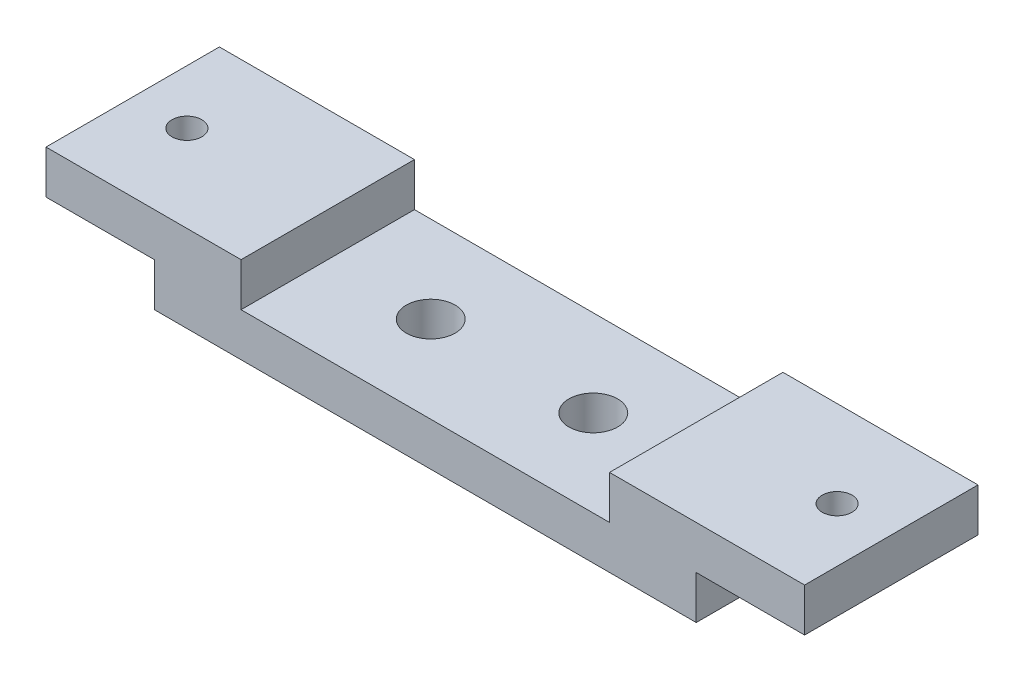
ISO-10303-21;
HEADER;
FILE_DESCRIPTION(('STEP AP214'),'2;1');
FILE_NAME('part.step','',(''),(''),'','','');
FILE_SCHEMA(('AUTOMOTIVE_DESIGN { 1 0 10303 214 1 1 1 1 }'));
ENDSEC;
DATA;
#1=APPLICATION_CONTEXT('core data for automotive mechanical design processes');
#2=APPLICATION_PROTOCOL_DEFINITION('international standard','automotive_design',2000,#1);
#3=PRODUCT_CONTEXT('',#1,'mechanical');
#4=PRODUCT('Part','Part','',(#3));
#5=PRODUCT_RELATED_PRODUCT_CATEGORY('part','',(#4));
#6=PRODUCT_DEFINITION_FORMATION('','',#4);
#7=PRODUCT_DEFINITION_CONTEXT('part definition',#1,'design');
#8=PRODUCT_DEFINITION('design','',#6,#7);
#9=PRODUCT_DEFINITION_SHAPE('','',#8);
#10=(LENGTH_UNIT() NAMED_UNIT(*) SI_UNIT(.MILLI.,.METRE.));
#11=(NAMED_UNIT(*) PLANE_ANGLE_UNIT() SI_UNIT($,.RADIAN.));
#12=(NAMED_UNIT(*) SI_UNIT($,.STERADIAN.) SOLID_ANGLE_UNIT());
#13=UNCERTAINTY_MEASURE_WITH_UNIT(LENGTH_MEASURE(1.E-05),#10,'distance_accuracy_value','');
#14=(GEOMETRIC_REPRESENTATION_CONTEXT(3) GLOBAL_UNCERTAINTY_ASSIGNED_CONTEXT((#13)) GLOBAL_UNIT_ASSIGNED_CONTEXT((#10,
#11,#12)) REPRESENTATION_CONTEXT('',''));
#15=CARTESIAN_POINT('',(0.,0.,0.));
#16=DIRECTION('',(0.,0.,1.));
#17=DIRECTION('',(1.,0.,0.));
#18=AXIS2_PLACEMENT_3D('',#15,#16,#17);
#19=CARTESIAN_POINT('',(-50.,8.,32.));
#20=DIRECTION('',(0.,1.,0.));
#21=DIRECTION('',(0.,0.,1.));
#22=AXIS2_PLACEMENT_3D('',#19,#20,#21);
#23=PLANE('',#22);
#24=DIRECTION('',(1.,0.,0.));
#25=VECTOR('',#24,1.);
#26=CARTESIAN_POINT('',(-50.,8.,0.));
#27=LINE('',#26,#25);
#28=CARTESIAN_POINT('',(-70.,8.,0.));
#29=VERTEX_POINT('',#28);
#30=CARTESIAN_POINT('',(-50.,8.,0.));
#31=VERTEX_POINT('',#30);
#32=EDGE_CURVE('E170',#29,#31,#27,.T.);
#33=ORIENTED_EDGE('',*,*,#32,.T.);
#34=DIRECTION('',(0.,0.,-1.));
#35=VECTOR('',#34,1.);
#36=CARTESIAN_POINT('',(-50.,8.,32.));
#37=LINE('',#36,#35);
#38=CARTESIAN_POINT('',(-50.,8.,32.));
#39=VERTEX_POINT('',#38);
#40=EDGE_CURVE('E49',#39,#31,#37,.T.);
#41=ORIENTED_EDGE('',*,*,#40,.F.);
#42=DIRECTION('',(1.,0.,0.));
#43=VECTOR('',#42,1.);
#44=CARTESIAN_POINT('',(-50.,8.,32.));
#45=LINE('',#44,#43);
#46=CARTESIAN_POINT('',(-70.,8.,32.));
#47=VERTEX_POINT('',#46);
#48=EDGE_CURVE('E112',#47,#39,#45,.T.);
#49=ORIENTED_EDGE('',*,*,#48,.F.);
#50=DIRECTION('',(0.,0.,-1.));
#51=VECTOR('',#50,1.);
#52=CARTESIAN_POINT('',(-70.,8.,32.));
#53=LINE('',#52,#51);
#54=EDGE_CURVE('E11',#47,#29,#53,.T.);
#55=ORIENTED_EDGE('',*,*,#54,.T.);
#56=EDGE_LOOP('',(#33,#41,#49,#55));
#57=FACE_BOUND('',#56,.T.);
#58=CARTESIAN_POINT('',(-60.,8.,16.));
#59=DIRECTION('',(0.,-1.,0.));
#60=DIRECTION('',(0.,0.,-1.));
#61=AXIS2_PLACEMENT_3D('',#58,#59,#60);
#62=CIRCLE('',#61,2.75);
#63=CARTESIAN_POINT('',(-60.,8.,13.25));
#64=VERTEX_POINT('',#63);
#65=EDGE_CURVE('E428',#64,#64,#62,.T.);
#66=ORIENTED_EDGE('',*,*,#65,.F.);
#67=EDGE_LOOP('',(#66));
#68=FACE_BOUND('',#67,.T.);
#69=ADVANCED_FACE('F39',(#57,#68),#23,.F.);
#70=CARTESIAN_POINT('',(-34.,8.,32.));
#71=DIRECTION('',(0.,-1.,0.));
#72=DIRECTION('',(0.,0.,-1.));
#73=AXIS2_PLACEMENT_3D('',#70,#71,#72);
#74=PLANE('',#73);
#75=CARTESIAN_POINT('',(-15.,8.,16.));
#76=DIRECTION('',(0.,1.,0.));
#77=DIRECTION('',(0.,0.,1.));
#78=AXIS2_PLACEMENT_3D('',#75,#76,#77);
#79=CIRCLE('',#78,4.5);
#80=CARTESIAN_POINT('',(-15.,8.,20.5));
#81=VERTEX_POINT('',#80);
#82=EDGE_CURVE('E450',#81,#81,#79,.T.);
#83=ORIENTED_EDGE('',*,*,#82,.F.);
#84=EDGE_LOOP('',(#83));
#85=FACE_BOUND('',#84,.T.);
#86=DIRECTION('',(-1.,0.,0.));
#87=VECTOR('',#86,1.);
#88=CARTESIAN_POINT('',(-34.,8.,0.));
#89=LINE('',#88,#87);
#90=CARTESIAN_POINT('',(34.,8.,0.));
#91=VERTEX_POINT('',#90);
#92=CARTESIAN_POINT('',(-34.,8.,0.));
#93=VERTEX_POINT('',#92);
#94=EDGE_CURVE('E153',#91,#93,#89,.T.);
#95=ORIENTED_EDGE('',*,*,#94,.T.);
#96=DIRECTION('',(0.,0.,-1.));
#97=VECTOR('',#96,1.);
#98=CARTESIAN_POINT('',(-34.,8.,32.));
#99=LINE('',#98,#97);
#100=CARTESIAN_POINT('',(-34.,8.,32.));
#101=VERTEX_POINT('',#100);
#102=EDGE_CURVE('E149',#101,#93,#99,.T.);
#103=ORIENTED_EDGE('',*,*,#102,.F.);
#104=DIRECTION('',(-1.,0.,0.));
#105=VECTOR('',#104,1.);
#106=CARTESIAN_POINT('',(-34.,8.,32.));
#107=LINE('',#106,#105);
#108=CARTESIAN_POINT('',(34.,8.,32.));
#109=VERTEX_POINT('',#108);
#110=EDGE_CURVE('E137',#109,#101,#107,.T.);
#111=ORIENTED_EDGE('',*,*,#110,.F.);
#112=DIRECTION('',(0.,0.,-1.));
#113=VECTOR('',#112,1.);
#114=CARTESIAN_POINT('',(34.,8.,32.));
#115=LINE('',#114,#113);
#116=EDGE_CURVE('E155',#109,#91,#115,.T.);
#117=ORIENTED_EDGE('',*,*,#116,.T.);
#118=EDGE_LOOP('',(#95,#103,#111,#117));
#119=FACE_BOUND('',#118,.T.);
#120=CARTESIAN_POINT('',(15.,8.,16.));
#121=DIRECTION('',(0.,1.,0.));
#122=DIRECTION('',(0.,0.,1.));
#123=AXIS2_PLACEMENT_3D('',#120,#121,#122);
#124=CIRCLE('',#123,4.5);
#125=CARTESIAN_POINT('',(15.,8.,20.5));
#126=VERTEX_POINT('',#125);
#127=EDGE_CURVE('E442',#126,#126,#124,.T.);
#128=ORIENTED_EDGE('',*,*,#127,.F.);
#129=EDGE_LOOP('',(#128));
#130=FACE_BOUND('',#129,.T.);
#131=ADVANCED_FACE('F150',(#85,#119,#130),#74,.F.);
#132=CARTESIAN_POINT('',(-70.,8.,32.));
#133=DIRECTION('',(1.,0.,0.));
#134=DIRECTION('',(0.,0.,-1.));
#135=AXIS2_PLACEMENT_3D('',#132,#133,#134);
#136=PLANE('',#135);
#137=DIRECTION('',(0.,-1.,0.));
#138=VECTOR('',#137,1.);
#139=CARTESIAN_POINT('',(-70.,8.,0.));
#140=LINE('',#139,#138);
#141=CARTESIAN_POINT('',(-70.,16.,0.));
#142=VERTEX_POINT('',#141);
#143=EDGE_CURVE('E166',#142,#29,#140,.T.);
#144=ORIENTED_EDGE('',*,*,#143,.T.);
#145=ORIENTED_EDGE('',*,*,#54,.F.);
#146=DIRECTION('',(0.,-1.,0.));
#147=VECTOR('',#146,1.);
#148=CARTESIAN_POINT('',(-70.,8.,32.));
#149=LINE('',#148,#147);
#150=CARTESIAN_POINT('',(-70.,16.,32.));
#151=VERTEX_POINT('',#150);
#152=EDGE_CURVE('E201',#151,#47,#149,.T.);
#153=ORIENTED_EDGE('',*,*,#152,.F.);
#154=DIRECTION('',(0.,0.,-1.));
#155=VECTOR('',#154,1.);
#156=CARTESIAN_POINT('',(-70.,16.,32.));
#157=LINE('',#156,#155);
#158=EDGE_CURVE('E162',#151,#142,#157,.T.);
#159=ORIENTED_EDGE('',*,*,#158,.T.);
#160=EDGE_LOOP('',(#144,#145,#153,#159));
#161=FACE_BOUND('',#160,.T.);
#162=ADVANCED_FACE('F41',(#161),#136,.F.);
#163=CARTESIAN_POINT('',(-50.,8.,32.));
#164=DIRECTION('',(1.,0.,0.));
#165=DIRECTION('',(0.,0.,-1.));
#166=AXIS2_PLACEMENT_3D('',#163,#164,#165);
#167=PLANE('',#166);
#168=DIRECTION('',(0.,-1.,0.));
#169=VECTOR('',#168,1.);
#170=CARTESIAN_POINT('',(-50.,8.,0.));
#171=LINE('',#170,#169);
#172=CARTESIAN_POINT('',(-50.,0.,0.));
#173=VERTEX_POINT('',#172);
#174=EDGE_CURVE('E174',#31,#173,#171,.T.);
#175=ORIENTED_EDGE('',*,*,#174,.T.);
#176=DIRECTION('',(0.,0.,-1.));
#177=VECTOR('',#176,1.);
#178=CARTESIAN_POINT('',(-50.,0.,32.));
#179=LINE('',#178,#177);
#180=CARTESIAN_POINT('',(-50.,0.,32.));
#181=VERTEX_POINT('',#180);
#182=EDGE_CURVE('E228',#181,#173,#179,.T.);
#183=ORIENTED_EDGE('',*,*,#182,.F.);
#184=DIRECTION('',(0.,-1.,0.));
#185=VECTOR('',#184,1.);
#186=CARTESIAN_POINT('',(-50.,8.,32.));
#187=LINE('',#186,#185);
#188=EDGE_CURVE('E238',#39,#181,#187,.T.);
#189=ORIENTED_EDGE('',*,*,#188,.F.);
#190=ORIENTED_EDGE('',*,*,#40,.T.);
#191=EDGE_LOOP('',(#175,#183,#189,#190));
#192=FACE_BOUND('',#191,.T.);
#193=ADVANCED_FACE('F236',(#192),#167,.F.);
#194=CARTESIAN_POINT('',(-50.,0.,32.));
#195=DIRECTION('',(0.,1.,0.));
#196=DIRECTION('',(-1.,0.,0.));
#197=AXIS2_PLACEMENT_3D('',#194,#195,#196);
#198=PLANE('',#197);
#199=CARTESIAN_POINT('',(15.,0.,16.));
#200=DIRECTION('',(0.,1.,0.));
#201=DIRECTION('',(0.,0.,1.));
#202=AXIS2_PLACEMENT_3D('',#199,#200,#201);
#203=CIRCLE('',#202,4.5);
#204=CARTESIAN_POINT('',(15.,0.,20.5));
#205=VERTEX_POINT('',#204);
#206=EDGE_CURVE('E446',#205,#205,#203,.T.);
#207=ORIENTED_EDGE('',*,*,#206,.T.);
#208=EDGE_LOOP('',(#207));
#209=FACE_BOUND('',#208,.T.);
#210=CARTESIAN_POINT('',(-15.,0.,16.));
#211=DIRECTION('',(0.,1.,0.));
#212=DIRECTION('',(0.,0.,1.));
#213=AXIS2_PLACEMENT_3D('',#210,#211,#212);
#214=CIRCLE('',#213,4.5);
#215=CARTESIAN_POINT('',(-15.,0.,20.5));
#216=VERTEX_POINT('',#215);
#217=EDGE_CURVE('E171',#216,#216,#214,.T.);
#218=ORIENTED_EDGE('',*,*,#217,.T.);
#219=EDGE_LOOP('',(#218));
#220=FACE_BOUND('',#219,.T.);
#221=DIRECTION('',(1.,0.,0.));
#222=VECTOR('',#221,1.);
#223=CARTESIAN_POINT('',(-50.,0.,0.));
#224=LINE('',#223,#222);
#225=CARTESIAN_POINT('',(50.,0.,0.));
#226=VERTEX_POINT('',#225);
#227=EDGE_CURVE('E177',#173,#226,#224,.T.);
#228=ORIENTED_EDGE('',*,*,#227,.T.);
#229=DIRECTION('',(0.,0.,-1.));
#230=VECTOR('',#229,1.);
#231=CARTESIAN_POINT('',(50.,0.,32.));
#232=LINE('',#231,#230);
#233=CARTESIAN_POINT('',(50.,0.,32.));
#234=VERTEX_POINT('',#233);
#235=EDGE_CURVE('E224',#234,#226,#232,.T.);
#236=ORIENTED_EDGE('',*,*,#235,.F.);
#237=DIRECTION('',(1.,0.,0.));
#238=VECTOR('',#237,1.);
#239=CARTESIAN_POINT('',(-50.,0.,32.));
#240=LINE('',#239,#238);
#241=EDGE_CURVE('E257',#181,#234,#240,.T.);
#242=ORIENTED_EDGE('',*,*,#241,.F.);
#243=ORIENTED_EDGE('',*,*,#182,.T.);
#244=EDGE_LOOP('',(#228,#236,#242,#243));
#245=FACE_BOUND('',#244,.T.);
#246=ADVANCED_FACE('F247',(#209,#220,#245),#198,.F.);
#247=CARTESIAN_POINT('',(50.,0.,32.));
#248=DIRECTION('',(-1.,0.,0.));
#249=DIRECTION('',(0.,0.,1.));
#250=AXIS2_PLACEMENT_3D('',#247,#248,#249);
#251=PLANE('',#250);
#252=DIRECTION('',(0.,1.,0.));
#253=VECTOR('',#252,1.);
#254=CARTESIAN_POINT('',(50.,0.,0.));
#255=LINE('',#254,#253);
#256=CARTESIAN_POINT('',(50.,8.00000000000002,0.));
#257=VERTEX_POINT('',#256);
#258=EDGE_CURVE('E180',#226,#257,#255,.T.);
#259=ORIENTED_EDGE('',*,*,#258,.T.);
#260=DIRECTION('',(0.,0.,-1.));
#261=VECTOR('',#260,1.);
#262=CARTESIAN_POINT('',(50.,8.00000000000002,32.));
#263=LINE('',#262,#261);
#264=CARTESIAN_POINT('',(50.,8.00000000000002,32.));
#265=VERTEX_POINT('',#264);
#266=EDGE_CURVE('E220',#265,#257,#263,.T.);
#267=ORIENTED_EDGE('',*,*,#266,.F.);
#268=DIRECTION('',(0.,1.,0.));
#269=VECTOR('',#268,1.);
#270=CARTESIAN_POINT('',(50.,0.,32.));
#271=LINE('',#270,#269);
#272=EDGE_CURVE('E253',#234,#265,#271,.T.);
#273=ORIENTED_EDGE('',*,*,#272,.F.);
#274=ORIENTED_EDGE('',*,*,#235,.T.);
#275=EDGE_LOOP('',(#259,#267,#273,#274));
#276=FACE_BOUND('',#275,.T.);
#277=ADVANCED_FACE('F251',(#276),#251,.F.);
#278=CARTESIAN_POINT('',(70.,8.,32.));
#279=DIRECTION('',(0.,1.,0.));
#280=DIRECTION('',(-1.,0.,0.));
#281=AXIS2_PLACEMENT_3D('',#278,#279,#280);
#282=PLANE('',#281);
#283=CARTESIAN_POINT('',(60.,8.00000000000001,16.));
#284=DIRECTION('',(0.,-1.,0.));
#285=DIRECTION('',(0.,0.,-1.));
#286=AXIS2_PLACEMENT_3D('',#283,#284,#285);
#287=CIRCLE('',#286,2.75);
#288=CARTESIAN_POINT('',(60.,8.00000000000001,13.25));
#289=VERTEX_POINT('',#288);
#290=EDGE_CURVE('E432',#289,#289,#287,.T.);
#291=ORIENTED_EDGE('',*,*,#290,.F.);
#292=EDGE_LOOP('',(#291));
#293=FACE_BOUND('',#292,.T.);
#294=DIRECTION('',(1.,0.,0.));
#295=VECTOR('',#294,1.);
#296=CARTESIAN_POINT('',(70.,8.,0.));
#297=LINE('',#296,#295);
#298=CARTESIAN_POINT('',(70.,8.,0.));
#299=VERTEX_POINT('',#298);
#300=EDGE_CURVE('E183',#257,#299,#297,.T.);
#301=ORIENTED_EDGE('',*,*,#300,.T.);
#302=DIRECTION('',(0.,0.,-1.));
#303=VECTOR('',#302,1.);
#304=CARTESIAN_POINT('',(70.,8.,32.));
#305=LINE('',#304,#303);
#306=CARTESIAN_POINT('',(70.,8.,32.));
#307=VERTEX_POINT('',#306);
#308=EDGE_CURVE('E216',#307,#299,#305,.T.);
#309=ORIENTED_EDGE('',*,*,#308,.F.);
#310=DIRECTION('',(1.,0.,0.));
#311=VECTOR('',#310,1.);
#312=CARTESIAN_POINT('',(70.,8.,32.));
#313=LINE('',#312,#311);
#314=EDGE_CURVE('E256',#265,#307,#313,.T.);
#315=ORIENTED_EDGE('',*,*,#314,.F.);
#316=ORIENTED_EDGE('',*,*,#266,.T.);
#317=EDGE_LOOP('',(#301,#309,#315,#316));
#318=FACE_BOUND('',#317,.T.);
#319=ADVANCED_FACE('F311',(#293,#318),#282,.F.);
#320=CARTESIAN_POINT('',(70.,16.,32.));
#321=DIRECTION('',(-1.,0.,0.));
#322=DIRECTION('',(0.,0.,1.));
#323=AXIS2_PLACEMENT_3D('',#320,#321,#322);
#324=PLANE('',#323);
#325=DIRECTION('',(0.,1.,0.));
#326=VECTOR('',#325,1.);
#327=CARTESIAN_POINT('',(70.,16.,0.));
#328=LINE('',#327,#326);
#329=CARTESIAN_POINT('',(70.,16.,0.));
#330=VERTEX_POINT('',#329);
#331=EDGE_CURVE('E186',#299,#330,#328,.T.);
#332=ORIENTED_EDGE('',*,*,#331,.T.);
#333=DIRECTION('',(0.,0.,-1.));
#334=VECTOR('',#333,1.);
#335=CARTESIAN_POINT('',(70.,16.,32.));
#336=LINE('',#335,#334);
#337=CARTESIAN_POINT('',(70.,16.,32.));
#338=VERTEX_POINT('',#337);
#339=EDGE_CURVE('E212',#338,#330,#336,.T.);
#340=ORIENTED_EDGE('',*,*,#339,.F.);
#341=DIRECTION('',(0.,1.,0.));
#342=VECTOR('',#341,1.);
#343=CARTESIAN_POINT('',(70.,16.,32.));
#344=LINE('',#343,#342);
#345=EDGE_CURVE('E261',#307,#338,#344,.T.);
#346=ORIENTED_EDGE('',*,*,#345,.F.);
#347=ORIENTED_EDGE('',*,*,#308,.T.);
#348=EDGE_LOOP('',(#332,#340,#346,#347));
#349=FACE_BOUND('',#348,.T.);
#350=ADVANCED_FACE('F314',(#349),#324,.F.);
#351=CARTESIAN_POINT('',(34.,16.,32.));
#352=DIRECTION('',(0.,-1.,0.));
#353=DIRECTION('',(0.,0.,-1.));
#354=AXIS2_PLACEMENT_3D('',#351,#352,#353);
#355=PLANE('',#354);
#356=CARTESIAN_POINT('',(60.,16.,16.));
#357=DIRECTION('',(0.,-1.,0.));
#358=DIRECTION('',(0.,0.,-1.));
#359=AXIS2_PLACEMENT_3D('',#356,#357,#358);
#360=CIRCLE('',#359,2.75);
#361=CARTESIAN_POINT('',(60.,16.,13.25));
#362=VERTEX_POINT('',#361);
#363=EDGE_CURVE('E438',#362,#362,#360,.T.);
#364=ORIENTED_EDGE('',*,*,#363,.T.);
#365=EDGE_LOOP('',(#364));
#366=FACE_BOUND('',#365,.T.);
#367=DIRECTION('',(-1.,0.,0.));
#368=VECTOR('',#367,1.);
#369=CARTESIAN_POINT('',(34.,16.,0.));
#370=LINE('',#369,#368);
#371=CARTESIAN_POINT('',(34.,16.,0.));
#372=VERTEX_POINT('',#371);
#373=EDGE_CURVE('E189',#330,#372,#370,.T.);
#374=ORIENTED_EDGE('',*,*,#373,.T.);
#375=DIRECTION('',(0.,0.,-1.));
#376=VECTOR('',#375,1.);
#377=CARTESIAN_POINT('',(34.,16.,32.));
#378=LINE('',#377,#376);
#379=CARTESIAN_POINT('',(34.,16.,32.));
#380=VERTEX_POINT('',#379);
#381=EDGE_CURVE('E208',#380,#372,#378,.T.);
#382=ORIENTED_EDGE('',*,*,#381,.F.);
#383=DIRECTION('',(-1.,0.,0.));
#384=VECTOR('',#383,1.);
#385=CARTESIAN_POINT('',(34.,16.,32.));
#386=LINE('',#385,#384);
#387=EDGE_CURVE('E268',#338,#380,#386,.T.);
#388=ORIENTED_EDGE('',*,*,#387,.F.);
#389=ORIENTED_EDGE('',*,*,#339,.T.);
#390=EDGE_LOOP('',(#374,#382,#388,#389));
#391=FACE_BOUND('',#390,.T.);
#392=ADVANCED_FACE('F276',(#366,#391),#355,.F.);
#393=CARTESIAN_POINT('',(34.,8.,32.));
#394=DIRECTION('',(1.,0.,0.));
#395=DIRECTION('',(0.,0.,-1.));
#396=AXIS2_PLACEMENT_3D('',#393,#394,#395);
#397=PLANE('',#396);
#398=DIRECTION('',(0.,-1.,0.));
#399=VECTOR('',#398,1.);
#400=CARTESIAN_POINT('',(34.,8.,0.));
#401=LINE('',#400,#399);
#402=EDGE_CURVE('E192',#372,#91,#401,.T.);
#403=ORIENTED_EDGE('',*,*,#402,.T.);
#404=ORIENTED_EDGE('',*,*,#116,.F.);
#405=DIRECTION('',(0.,-1.,0.));
#406=VECTOR('',#405,1.);
#407=CARTESIAN_POINT('',(34.,8.,32.));
#408=LINE('',#407,#406);
#409=EDGE_CURVE('E143',#380,#109,#408,.T.);
#410=ORIENTED_EDGE('',*,*,#409,.F.);
#411=ORIENTED_EDGE('',*,*,#381,.T.);
#412=EDGE_LOOP('',(#403,#404,#410,#411));
#413=FACE_BOUND('',#412,.T.);
#414=ADVANCED_FACE('F280',(#413),#397,.F.);
#415=CARTESIAN_POINT('',(-34.,16.,32.));
#416=DIRECTION('',(-1.,0.,0.));
#417=DIRECTION('',(0.,0.,1.));
#418=AXIS2_PLACEMENT_3D('',#415,#416,#417);
#419=PLANE('',#418);
#420=DIRECTION('',(0.,1.,0.));
#421=VECTOR('',#420,1.);
#422=CARTESIAN_POINT('',(-34.,16.,0.));
#423=LINE('',#422,#421);
#424=CARTESIAN_POINT('',(-34.,16.,0.));
#425=VERTEX_POINT('',#424);
#426=EDGE_CURVE('E98',#93,#425,#423,.T.);
#427=ORIENTED_EDGE('',*,*,#426,.T.);
#428=DIRECTION('',(0.,0.,-1.));
#429=VECTOR('',#428,1.);
#430=CARTESIAN_POINT('',(-34.,16.,32.));
#431=LINE('',#430,#429);
#432=CARTESIAN_POINT('',(-34.,16.,32.));
#433=VERTEX_POINT('',#432);
#434=EDGE_CURVE('E156',#433,#425,#431,.T.);
#435=ORIENTED_EDGE('',*,*,#434,.F.);
#436=DIRECTION('',(0.,1.,0.));
#437=VECTOR('',#436,1.);
#438=CARTESIAN_POINT('',(-34.,16.,32.));
#439=LINE('',#438,#437);
#440=EDGE_CURVE('E141',#101,#433,#439,.T.);
#441=ORIENTED_EDGE('',*,*,#440,.F.);
#442=ORIENTED_EDGE('',*,*,#102,.T.);
#443=EDGE_LOOP('',(#427,#435,#441,#442));
#444=FACE_BOUND('',#443,.T.);
#445=ADVANCED_FACE('F158',(#444),#419,.F.);
#446=CARTESIAN_POINT('',(-70.,16.,32.));
#447=DIRECTION('',(0.,-1.,0.));
#448=DIRECTION('',(0.,0.,-1.));
#449=AXIS2_PLACEMENT_3D('',#446,#447,#448);
#450=PLANE('',#449);
#451=CARTESIAN_POINT('',(-60.,16.,16.));
#452=DIRECTION('',(0.,-1.,0.));
#453=DIRECTION('',(0.,0.,-1.));
#454=AXIS2_PLACEMENT_3D('',#451,#452,#453);
#455=CIRCLE('',#454,2.75);
#456=CARTESIAN_POINT('',(-60.,16.,13.25));
#457=VERTEX_POINT('',#456);
#458=EDGE_CURVE('E425',#457,#457,#455,.T.);
#459=ORIENTED_EDGE('',*,*,#458,.T.);
#460=EDGE_LOOP('',(#459));
#461=FACE_BOUND('',#460,.T.);
#462=DIRECTION('',(-1.,0.,0.));
#463=VECTOR('',#462,1.);
#464=CARTESIAN_POINT('',(-70.,16.,0.));
#465=LINE('',#464,#463);
#466=EDGE_CURVE('E104',#425,#142,#465,.T.);
#467=ORIENTED_EDGE('',*,*,#466,.T.);
#468=ORIENTED_EDGE('',*,*,#158,.F.);
#469=DIRECTION('',(-1.,0.,0.));
#470=VECTOR('',#469,1.);
#471=CARTESIAN_POINT('',(-70.,16.,32.));
#472=LINE('',#471,#470);
#473=EDGE_CURVE('E57',#433,#151,#472,.T.);
#474=ORIENTED_EDGE('',*,*,#473,.F.);
#475=ORIENTED_EDGE('',*,*,#434,.T.);
#476=EDGE_LOOP('',(#467,#468,#474,#475));
#477=FACE_BOUND('',#476,.T.);
#478=ADVANCED_FACE('F284',(#461,#477),#450,.F.);
#479=CARTESIAN_POINT('',(0.,0.,32.));
#480=DIRECTION('',(0.,0.,-1.));
#481=DIRECTION('',(-1.,0.,0.));
#482=AXIS2_PLACEMENT_3D('',#479,#480,#481);
#483=PLANE('',#482);
#484=ORIENTED_EDGE('',*,*,#152,.T.);
#485=ORIENTED_EDGE('',*,*,#48,.T.);
#486=ORIENTED_EDGE('',*,*,#188,.T.);
#487=ORIENTED_EDGE('',*,*,#241,.T.);
#488=ORIENTED_EDGE('',*,*,#272,.T.);
#489=ORIENTED_EDGE('',*,*,#314,.T.);
#490=ORIENTED_EDGE('',*,*,#345,.T.);
#491=ORIENTED_EDGE('',*,*,#387,.T.);
#492=ORIENTED_EDGE('',*,*,#409,.T.);
#493=ORIENTED_EDGE('',*,*,#110,.T.);
#494=ORIENTED_EDGE('',*,*,#440,.T.);
#495=ORIENTED_EDGE('',*,*,#473,.T.);
#496=EDGE_LOOP('',(#484,#485,#486,#487,#488,#489,#490,#491,#492,#493,#494,#495));
#497=FACE_BOUND('',#496,.T.);
#498=ADVANCED_FACE('F139',(#497),#483,.F.);
#499=CARTESIAN_POINT('',(0.,0.,0.));
#500=DIRECTION('',(0.,0.,-1.));
#501=DIRECTION('',(-1.,0.,0.));
#502=AXIS2_PLACEMENT_3D('',#499,#500,#501);
#503=PLANE('',#502);
#504=ORIENTED_EDGE('',*,*,#143,.F.);
#505=ORIENTED_EDGE('',*,*,#466,.F.);
#506=ORIENTED_EDGE('',*,*,#426,.F.);
#507=ORIENTED_EDGE('',*,*,#94,.F.);
#508=ORIENTED_EDGE('',*,*,#402,.F.);
#509=ORIENTED_EDGE('',*,*,#373,.F.);
#510=ORIENTED_EDGE('',*,*,#331,.F.);
#511=ORIENTED_EDGE('',*,*,#300,.F.);
#512=ORIENTED_EDGE('',*,*,#258,.F.);
#513=ORIENTED_EDGE('',*,*,#227,.F.);
#514=ORIENTED_EDGE('',*,*,#174,.F.);
#515=ORIENTED_EDGE('',*,*,#32,.F.);
#516=EDGE_LOOP('',(#504,#505,#506,#507,#508,#509,#510,#511,#512,#513,#514,#515));
#517=FACE_BOUND('',#516,.T.);
#518=ADVANCED_FACE('F242',(#517),#503,.T.);
#519=CARTESIAN_POINT('',(-15.,8.,16.));
#520=DIRECTION('',(0.,1.,0.));
#521=DIRECTION('',(0.,0.,1.));
#522=AXIS2_PLACEMENT_3D('',#519,#520,#521);
#523=CYLINDRICAL_SURFACE('',#522,4.5);
#524=ORIENTED_EDGE('',*,*,#217,.F.);
#525=EDGE_LOOP('',(#524));
#526=FACE_BOUND('',#525,.T.);
#527=ORIENTED_EDGE('',*,*,#82,.T.);
#528=EDGE_LOOP('',(#527));
#529=FACE_BOUND('',#528,.T.);
#530=ADVANCED_FACE('F348',(#526,#529),#523,.F.);
#531=CARTESIAN_POINT('',(15.,8.,16.));
#532=DIRECTION('',(0.,1.,0.));
#533=DIRECTION('',(0.,0.,1.));
#534=AXIS2_PLACEMENT_3D('',#531,#532,#533);
#535=CYLINDRICAL_SURFACE('',#534,4.5);
#536=ORIENTED_EDGE('',*,*,#206,.F.);
#537=EDGE_LOOP('',(#536));
#538=FACE_BOUND('',#537,.T.);
#539=ORIENTED_EDGE('',*,*,#127,.T.);
#540=EDGE_LOOP('',(#539));
#541=FACE_BOUND('',#540,.T.);
#542=ADVANCED_FACE('F371',(#538,#541),#535,.F.);
#543=CARTESIAN_POINT('',(60.,8.00000000000001,16.));
#544=DIRECTION('',(0.,-1.,0.));
#545=DIRECTION('',(0.,0.,-1.));
#546=AXIS2_PLACEMENT_3D('',#543,#544,#545);
#547=CYLINDRICAL_SURFACE('',#546,2.75);
#548=ORIENTED_EDGE('',*,*,#363,.F.);
#549=EDGE_LOOP('',(#548));
#550=FACE_BOUND('',#549,.T.);
#551=ORIENTED_EDGE('',*,*,#290,.T.);
#552=EDGE_LOOP('',(#551));
#553=FACE_BOUND('',#552,.T.);
#554=ADVANCED_FACE('F380',(#550,#553),#547,.F.);
#555=CARTESIAN_POINT('',(-60.,8.,16.));
#556=DIRECTION('',(0.,-1.,0.));
#557=DIRECTION('',(0.,0.,-1.));
#558=AXIS2_PLACEMENT_3D('',#555,#556,#557);
#559=CYLINDRICAL_SURFACE('',#558,2.75);
#560=ORIENTED_EDGE('',*,*,#458,.F.);
#561=EDGE_LOOP('',(#560));
#562=FACE_BOUND('',#561,.T.);
#563=ORIENTED_EDGE('',*,*,#65,.T.);
#564=EDGE_LOOP('',(#563));
#565=FACE_BOUND('',#564,.T.);
#566=ADVANCED_FACE('F409',(#562,#565),#559,.F.);
#567=CLOSED_SHELL('',(#69,#131,#162,#193,#246,#277,#319,#350,#392,#414,#445,#478,#498,#518,#530,
#542,#554,#566));
#568=MANIFOLD_SOLID_BREP('B2',#567);
#569=ADVANCED_BREP_SHAPE_REPRESENTATION('',(#18,#568),#14);
#570=SHAPE_DEFINITION_REPRESENTATION(#9,#569);
ENDSEC;
END-ISO-10303-21;
